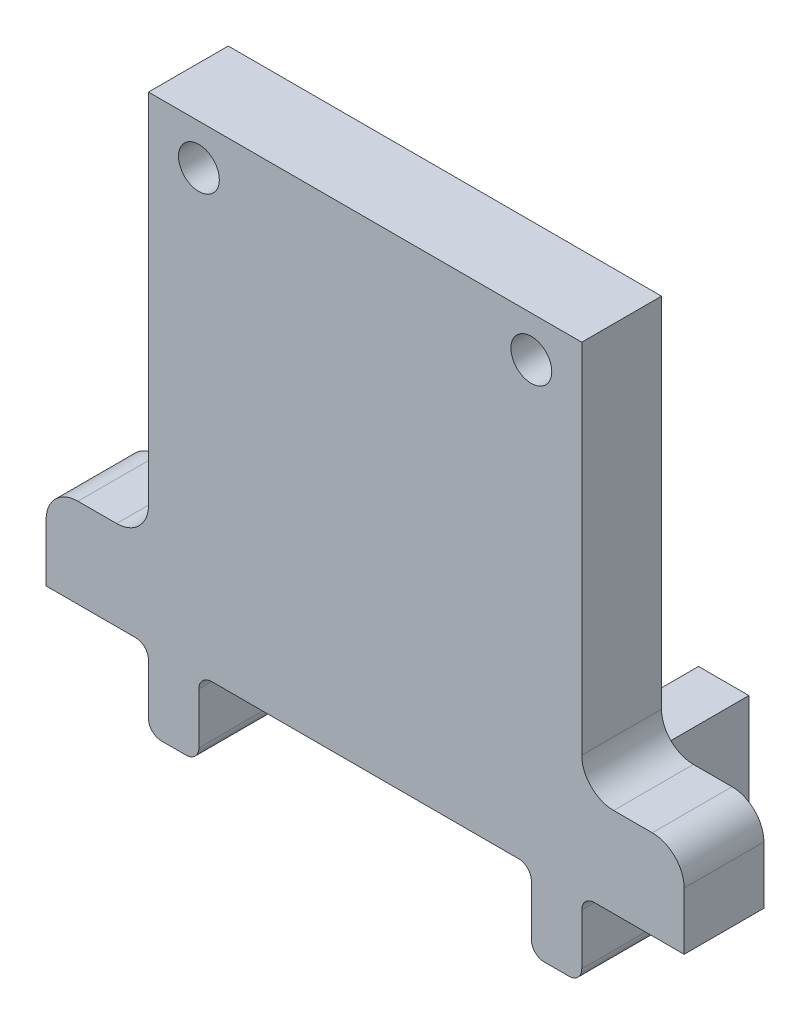
ISO-10303-21;
HEADER;
FILE_DESCRIPTION(('STEP AP214'),'2;1');
FILE_NAME('part.step','',(''),(''),'','','');
FILE_SCHEMA(('AUTOMOTIVE_DESIGN { 1 0 10303 214 1 1 1 1 }'));
ENDSEC;
DATA;
#1=APPLICATION_CONTEXT('core data for automotive mechanical design processes');
#2=APPLICATION_PROTOCOL_DEFINITION('international standard','automotive_design',2000,#1);
#3=PRODUCT_CONTEXT('',#1,'mechanical');
#4=PRODUCT('Part','Part','',(#3));
#5=PRODUCT_RELATED_PRODUCT_CATEGORY('part','',(#4));
#6=PRODUCT_DEFINITION_FORMATION('','',#4);
#7=PRODUCT_DEFINITION_CONTEXT('part definition',#1,'design');
#8=PRODUCT_DEFINITION('design','',#6,#7);
#9=PRODUCT_DEFINITION_SHAPE('','',#8);
#10=(LENGTH_UNIT() NAMED_UNIT(*) SI_UNIT(.MILLI.,.METRE.));
#11=(NAMED_UNIT(*) PLANE_ANGLE_UNIT() SI_UNIT($,.RADIAN.));
#12=(NAMED_UNIT(*) SI_UNIT($,.STERADIAN.) SOLID_ANGLE_UNIT());
#13=UNCERTAINTY_MEASURE_WITH_UNIT(LENGTH_MEASURE(1.E-05),#10,'distance_accuracy_value','');
#14=(GEOMETRIC_REPRESENTATION_CONTEXT(3) GLOBAL_UNCERTAINTY_ASSIGNED_CONTEXT((#13)) GLOBAL_UNIT_ASSIGNED_CONTEXT((#10,
#11,#12)) REPRESENTATION_CONTEXT('',''));
#15=CARTESIAN_POINT('',(0.,0.,0.));
#16=DIRECTION('',(0.,0.,1.));
#17=DIRECTION('',(1.,0.,0.));
#18=AXIS2_PLACEMENT_3D('',#15,#16,#17);
#19=CARTESIAN_POINT('',(0.,13.,0.));
#20=DIRECTION('',(0.,-1.,0.));
#21=DIRECTION('',(0.,0.,-1.));
#22=AXIS2_PLACEMENT_3D('',#19,#20,#21);
#23=PLANE('',#22);
#24=DIRECTION('',(1.,0.,0.));
#25=VECTOR('',#24,1.);
#26=CARTESIAN_POINT('',(-1.975,13.,0.));
#27=LINE('',#26,#25);
#28=CARTESIAN_POINT('',(34.475,13.,0.));
#29=VERTEX_POINT('',#28);
#30=CARTESIAN_POINT('',(37.5,13.,0.));
#31=VERTEX_POINT('',#30);
#32=EDGE_CURVE('E354',#29,#31,#27,.T.);
#33=ORIENTED_EDGE('',*,*,#32,.T.);
#34=DIRECTION('',(0.,0.,1.));
#35=VECTOR('',#34,1.);
#36=CARTESIAN_POINT('',(37.5,13.,-6.25000000000002));
#37=LINE('',#36,#35);
#38=CARTESIAN_POINT('',(37.5,13.,-6.25000000000002));
#39=VERTEX_POINT('',#38);
#40=EDGE_CURVE('E425',#31,#39,#37,.F.);
#41=ORIENTED_EDGE('',*,*,#40,.T.);
#42=DIRECTION('',(1.,0.,0.));
#43=VECTOR('',#42,1.);
#44=CARTESIAN_POINT('',(31.975,13.,-6.25000000000001));
#45=LINE('',#44,#43);
#46=CARTESIAN_POINT('',(34.475,13.,-6.25000000000001));
#47=VERTEX_POINT('',#46);
#48=EDGE_CURVE('E297',#47,#39,#45,.T.);
#49=ORIENTED_EDGE('',*,*,#48,.F.);
#50=DIRECTION('',(0.,0.,-1.));
#51=VECTOR('',#50,1.);
#52=CARTESIAN_POINT('',(34.475,13.,0.));
#53=LINE('',#52,#51);
#54=EDGE_CURVE('E423',#47,#29,#53,.F.);
#55=ORIENTED_EDGE('',*,*,#54,.T.);
#56=EDGE_LOOP('',(#33,#41,#49,#55));
#57=FACE_BOUND('',#56,.T.);
#58=ADVANCED_FACE('F41',(#57),#23,.F.);
#59=DIRECTION('',(-1.,0.,0.));
#60=VECTOR('',#59,1.);
#61=CARTESIAN_POINT('',(-1.975,13.,-6.25));
#62=LINE('',#61,#60);
#63=CARTESIAN_POINT('',(31.975,13.,-6.25000000000001));
#64=VERTEX_POINT('',#63);
#65=CARTESIAN_POINT('',(28.025,13.,-6.25000000000001));
#66=VERTEX_POINT('',#65);
#67=EDGE_CURVE('E270',#64,#66,#62,.T.);
#68=ORIENTED_EDGE('',*,*,#67,.F.);
#69=DIRECTION('',(0.,0.,1.));
#70=VECTOR('',#69,1.);
#71=CARTESIAN_POINT('',(31.975,13.,-13.1));
#72=LINE('',#71,#70);
#73=CARTESIAN_POINT('',(31.975,13.,-13.1));
#74=VERTEX_POINT('',#73);
#75=EDGE_CURVE('E318',#74,#64,#72,.T.);
#76=ORIENTED_EDGE('',*,*,#75,.F.);
#77=DIRECTION('',(1.,0.,0.));
#78=VECTOR('',#77,1.);
#79=CARTESIAN_POINT('',(28.025,13.,-13.1));
#80=LINE('',#79,#78);
#81=CARTESIAN_POINT('',(28.025,13.,-13.1));
#82=VERTEX_POINT('',#81);
#83=EDGE_CURVE('E322',#82,#74,#80,.T.);
#84=ORIENTED_EDGE('',*,*,#83,.F.);
#85=DIRECTION('',(0.,0.,-1.));
#86=VECTOR('',#85,1.);
#87=CARTESIAN_POINT('',(28.025,13.,-13.1));
#88=LINE('',#87,#86);
#89=EDGE_CURVE('E321',#66,#82,#88,.T.);
#90=ORIENTED_EDGE('',*,*,#89,.F.);
#91=EDGE_LOOP('',(#68,#76,#84,#90));
#92=FACE_BOUND('',#91,.T.);
#93=ADVANCED_FACE('F558',(#92),#23,.F.);
#94=DIRECTION('',(1.,0.,0.));
#95=VECTOR('',#94,1.);
#96=CARTESIAN_POINT('',(-1.975,13.,-6.25));
#97=LINE('',#96,#95);
#98=CARTESIAN_POINT('',(-7.5,13.,-6.25));
#99=VERTEX_POINT('',#98);
#100=CARTESIAN_POINT('',(-4.475,13.,-6.25));
#101=VERTEX_POINT('',#100);
#102=EDGE_CURVE('E308',#99,#101,#97,.T.);
#103=ORIENTED_EDGE('',*,*,#102,.F.);
#104=DIRECTION('',(0.,0.,1.));
#105=VECTOR('',#104,1.);
#106=CARTESIAN_POINT('',(-7.5,13.,0.));
#107=LINE('',#106,#105);
#108=CARTESIAN_POINT('',(-7.5,13.,0.));
#109=VERTEX_POINT('',#108);
#110=EDGE_CURVE('E432',#99,#109,#107,.T.);
#111=ORIENTED_EDGE('',*,*,#110,.T.);
#112=CARTESIAN_POINT('',(-4.475,13.,0.));
#113=VERTEX_POINT('',#112);
#114=EDGE_CURVE('E356',#109,#113,#27,.T.);
#115=ORIENTED_EDGE('',*,*,#114,.T.);
#116=DIRECTION('',(0.,0.,1.));
#117=VECTOR('',#116,1.);
#118=CARTESIAN_POINT('',(-4.475,13.,-6.25));
#119=LINE('',#118,#117);
#120=EDGE_CURVE('E430',#113,#101,#119,.F.);
#121=ORIENTED_EDGE('',*,*,#120,.T.);
#122=EDGE_LOOP('',(#103,#111,#115,#121));
#123=FACE_BOUND('',#122,.T.);
#124=ADVANCED_FACE('F565',(#123),#23,.F.);
#125=CARTESIAN_POINT('',(1.975,13.,-6.25));
#126=VERTEX_POINT('',#125);
#127=CARTESIAN_POINT('',(-1.975,13.,-6.25));
#128=VERTEX_POINT('',#127);
#129=EDGE_CURVE('E415',#126,#128,#62,.T.);
#130=ORIENTED_EDGE('',*,*,#129,.F.);
#131=DIRECTION('',(0.,0.,-1.));
#132=VECTOR('',#131,1.);
#133=CARTESIAN_POINT('',(1.975,13.,0.));
#134=LINE('',#133,#132);
#135=CARTESIAN_POINT('',(1.97499999999999,13.,-13.1));
#136=VERTEX_POINT('',#135);
#137=EDGE_CURVE('E359',#126,#136,#134,.T.);
#138=ORIENTED_EDGE('',*,*,#137,.T.);
#139=DIRECTION('',(-1.,0.,0.));
#140=VECTOR('',#139,1.);
#141=CARTESIAN_POINT('',(-1.975,13.,-13.1));
#142=LINE('',#141,#140);
#143=CARTESIAN_POINT('',(-1.975,13.,-13.1));
#144=VERTEX_POINT('',#143);
#145=EDGE_CURVE('E361',#136,#144,#142,.T.);
#146=ORIENTED_EDGE('',*,*,#145,.T.);
#147=DIRECTION('',(0.,0.,1.));
#148=VECTOR('',#147,1.);
#149=CARTESIAN_POINT('',(-1.975,13.,0.));
#150=LINE('',#149,#148);
#151=EDGE_CURVE('E352',#144,#128,#150,.T.);
#152=ORIENTED_EDGE('',*,*,#151,.T.);
#153=EDGE_LOOP('',(#130,#138,#146,#152));
#154=FACE_BOUND('',#153,.T.);
#155=ADVANCED_FACE('F560',(#154),#23,.F.);
#156=CARTESIAN_POINT('',(31.975,26.6825618946161,-13.1));
#157=DIRECTION('',(-1.,0.,0.));
#158=DIRECTION('',(0.,0.,1.));
#159=AXIS2_PLACEMENT_3D('',#156,#157,#158);
#160=PLANE('',#159);
#161=DIRECTION('',(0.,1.,0.));
#162=VECTOR('',#161,1.);
#163=CARTESIAN_POINT('',(31.975,13.,-6.25000000000001));
#164=LINE('',#163,#162);
#165=CARTESIAN_POINT('',(31.975,5.,-6.25000000000001));
#166=VERTEX_POINT('',#165);
#167=EDGE_CURVE('E279',#166,#64,#164,.T.);
#168=ORIENTED_EDGE('',*,*,#167,.F.);
#169=DIRECTION('',(0.,0.,1.));
#170=VECTOR('',#169,1.);
#171=CARTESIAN_POINT('',(31.975,5.,-13.1));
#172=LINE('',#171,#170);
#173=CARTESIAN_POINT('',(31.975,5.,0.));
#174=VERTEX_POINT('',#173);
#175=EDGE_CURVE('E463',#166,#174,#172,.T.);
#176=ORIENTED_EDGE('',*,*,#175,.T.);
#177=DIRECTION('',(0.,-1.,0.));
#178=VECTOR('',#177,1.);
#179=CARTESIAN_POINT('',(31.975,26.6825618946161,0.));
#180=LINE('',#179,#178);
#181=CARTESIAN_POINT('',(31.975,1.,0.));
#182=VERTEX_POINT('',#181);
#183=EDGE_CURVE('E335',#174,#182,#180,.T.);
#184=ORIENTED_EDGE('',*,*,#183,.T.);
#185=DIRECTION('',(0.,0.,-1.));
#186=VECTOR('',#185,1.);
#187=CARTESIAN_POINT('',(31.975,1.,-13.1));
#188=LINE('',#187,#186);
#189=CARTESIAN_POINT('',(31.975,1.,-13.1));
#190=VERTEX_POINT('',#189);
#191=EDGE_CURVE('E377',#182,#190,#188,.T.);
#192=ORIENTED_EDGE('',*,*,#191,.T.);
#193=DIRECTION('',(0.,-1.,0.));
#194=VECTOR('',#193,1.);
#195=CARTESIAN_POINT('',(31.975,26.6825618946161,-13.1));
#196=LINE('',#195,#194);
#197=EDGE_CURVE('E332',#74,#190,#196,.T.);
#198=ORIENTED_EDGE('',*,*,#197,.F.);
#199=ORIENTED_EDGE('',*,*,#75,.T.);
#200=EDGE_LOOP('',(#168,#176,#184,#192,#198,#199));
#201=FACE_BOUND('',#200,.T.);
#202=ADVANCED_FACE('F515',(#201),#160,.F.);
#203=CARTESIAN_POINT('',(-1.975,13.,0.));
#204=DIRECTION('',(1.,0.,0.));
#205=DIRECTION('',(0.,0.,-1.));
#206=AXIS2_PLACEMENT_3D('',#203,#204,#205);
#207=PLANE('',#206);
#208=DIRECTION('',(0.,-1.,0.));
#209=VECTOR('',#208,1.);
#210=CARTESIAN_POINT('',(-1.975,13.,0.));
#211=LINE('',#210,#209);
#212=CARTESIAN_POINT('',(-1.975,5.,0.));
#213=VERTEX_POINT('',#212);
#214=CARTESIAN_POINT('',(-1.975,1.,0.));
#215=VERTEX_POINT('',#214);
#216=EDGE_CURVE('E375',#213,#215,#211,.T.);
#217=ORIENTED_EDGE('',*,*,#216,.F.);
#218=DIRECTION('',(0.,0.,1.));
#219=VECTOR('',#218,1.);
#220=CARTESIAN_POINT('',(-1.975,5.,0.));
#221=LINE('',#220,#219);
#222=CARTESIAN_POINT('',(-1.975,5.,-6.25));
#223=VERTEX_POINT('',#222);
#224=EDGE_CURVE('E453',#213,#223,#221,.F.);
#225=ORIENTED_EDGE('',*,*,#224,.T.);
#226=DIRECTION('',(0.,-1.,0.));
#227=VECTOR('',#226,1.);
#228=CARTESIAN_POINT('',(-1.975,13.,-6.25));
#229=LINE('',#228,#227);
#230=EDGE_CURVE('E306',#128,#223,#229,.T.);
#231=ORIENTED_EDGE('',*,*,#230,.F.);
#232=ORIENTED_EDGE('',*,*,#151,.F.);
#233=DIRECTION('',(0.,-1.,0.));
#234=VECTOR('',#233,1.);
#235=CARTESIAN_POINT('',(-1.975,13.,-13.1));
#236=LINE('',#235,#234);
#237=CARTESIAN_POINT('',(-1.975,1.,-13.1));
#238=VERTEX_POINT('',#237);
#239=EDGE_CURVE('E363',#144,#238,#236,.T.);
#240=ORIENTED_EDGE('',*,*,#239,.T.);
#241=DIRECTION('',(0.,0.,1.));
#242=VECTOR('',#241,1.);
#243=CARTESIAN_POINT('',(-1.975,0.999999999999999,0.));
#244=LINE('',#243,#242);
#245=EDGE_CURVE('E412',#238,#215,#244,.T.);
#246=ORIENTED_EDGE('',*,*,#245,.T.);
#247=EDGE_LOOP('',(#217,#225,#231,#232,#240,#246));
#248=FACE_BOUND('',#247,.T.);
#249=ADVANCED_FACE('F575',(#248),#207,.F.);
#250=CARTESIAN_POINT('',(1.975,13.,0.));
#251=DIRECTION('',(-1.,0.,0.));
#252=DIRECTION('',(0.,0.,1.));
#253=AXIS2_PLACEMENT_3D('',#250,#251,#252);
#254=PLANE('',#253);
#255=DIRECTION('',(0.,1.,0.));
#256=VECTOR('',#255,1.);
#257=CARTESIAN_POINT('',(1.975,13.,-6.25));
#258=LINE('',#257,#256);
#259=CARTESIAN_POINT('',(1.975,5.,-6.25));
#260=VERTEX_POINT('',#259);
#261=EDGE_CURVE('E341',#260,#126,#258,.T.);
#262=ORIENTED_EDGE('',*,*,#261,.F.);
#263=DIRECTION('',(0.,0.,-1.));
#264=VECTOR('',#263,1.);
#265=CARTESIAN_POINT('',(1.975,5.,0.));
#266=LINE('',#265,#264);
#267=CARTESIAN_POINT('',(1.975,5.,0.));
#268=VERTEX_POINT('',#267);
#269=EDGE_CURVE('E461',#260,#268,#266,.F.);
#270=ORIENTED_EDGE('',*,*,#269,.T.);
#271=DIRECTION('',(0.,-1.,0.));
#272=VECTOR('',#271,1.);
#273=CARTESIAN_POINT('',(1.975,13.,0.));
#274=LINE('',#273,#272);
#275=CARTESIAN_POINT('',(1.975,1.,0.));
#276=VERTEX_POINT('',#275);
#277=EDGE_CURVE('E373',#268,#276,#274,.T.);
#278=ORIENTED_EDGE('',*,*,#277,.T.);
#279=DIRECTION('',(0.,0.,-1.));
#280=VECTOR('',#279,1.);
#281=CARTESIAN_POINT('',(1.97499999999999,0.999999999999999,-13.1));
#282=LINE('',#281,#280);
#283=CARTESIAN_POINT('',(1.97499999999999,1.,-13.1));
#284=VERTEX_POINT('',#283);
#285=EDGE_CURVE('E401',#276,#284,#282,.T.);
#286=ORIENTED_EDGE('',*,*,#285,.T.);
#287=DIRECTION('',(0.,-1.,0.));
#288=VECTOR('',#287,1.);
#289=CARTESIAN_POINT('',(1.97499999999999,13.,-13.1));
#290=LINE('',#289,#288);
#291=EDGE_CURVE('E370',#136,#284,#290,.T.);
#292=ORIENTED_EDGE('',*,*,#291,.F.);
#293=ORIENTED_EDGE('',*,*,#137,.F.);
#294=EDGE_LOOP('',(#262,#270,#278,#286,#292,#293));
#295=FACE_BOUND('',#294,.T.);
#296=ADVANCED_FACE('F585',(#295),#254,.F.);
#297=CARTESIAN_POINT('',(-1.975,13.,0.));
#298=DIRECTION('',(0.,0.,-1.));
#299=DIRECTION('',(-1.,0.,0.));
#300=AXIS2_PLACEMENT_3D('',#297,#298,#299);
#301=PLANE('',#300);
#302=CARTESIAN_POINT('',(1.975,40.3533,0.));
#303=DIRECTION('',(0.,0.,1.));
#304=DIRECTION('',(1.,0.,0.));
#305=AXIS2_PLACEMENT_3D('',#302,#303,#304);
#306=CIRCLE('',#305,1.59999999999999);
#307=CARTESIAN_POINT('',(3.57499999999998,40.3533,0.));
#308=VERTEX_POINT('',#307);
#309=EDGE_CURVE('E992',#308,#308,#306,.T.);
#310=ORIENTED_EDGE('',*,*,#309,.F.);
#311=EDGE_LOOP('',(#310));
#312=FACE_BOUND('',#311,.T.);
#313=CARTESIAN_POINT('',(28.025,40.3533,0.));
#314=DIRECTION('',(0.,0.,1.));
#315=DIRECTION('',(1.,0.,0.));
#316=AXIS2_PLACEMENT_3D('',#313,#314,#315);
#317=CIRCLE('',#316,1.59999999999999);
#318=CARTESIAN_POINT('',(29.625,40.3533,0.));
#319=VERTEX_POINT('',#318);
#320=EDGE_CURVE('E966',#319,#319,#317,.T.);
#321=ORIENTED_EDGE('',*,*,#320,.F.);
#322=EDGE_LOOP('',(#321));
#323=FACE_BOUND('',#322,.T.);
#324=DIRECTION('',(0.,1.,0.));
#325=VECTOR('',#324,1.);
#326=CARTESIAN_POINT('',(40.,13.,0.));
#327=LINE('',#326,#325);
#328=CARTESIAN_POINT('',(40.,6.,0.));
#329=VERTEX_POINT('',#328);
#330=CARTESIAN_POINT('',(40.,10.5,0.));
#331=VERTEX_POINT('',#330);
#332=EDGE_CURVE('E288',#329,#331,#327,.T.);
#333=ORIENTED_EDGE('',*,*,#332,.T.);
#334=CARTESIAN_POINT('',(37.5,10.5,0.));
#335=DIRECTION('',(0.,0.,-1.));
#336=DIRECTION('',(-1.,0.,0.));
#337=AXIS2_PLACEMENT_3D('',#334,#335,#336);
#338=CIRCLE('',#337,2.5);
#339=EDGE_CURVE('E421',#331,#31,#338,.F.);
#340=ORIENTED_EDGE('',*,*,#339,.T.);
#341=ORIENTED_EDGE('',*,*,#32,.F.);
#342=CARTESIAN_POINT('',(34.475,15.5,0.));
#343=DIRECTION('',(0.,0.,-1.));
#344=DIRECTION('',(-1.,0.,0.));
#345=AXIS2_PLACEMENT_3D('',#342,#343,#344);
#346=CIRCLE('',#345,2.5);
#347=CARTESIAN_POINT('',(31.975,15.5,0.));
#348=VERTEX_POINT('',#347);
#349=EDGE_CURVE('E444',#29,#348,#346,.T.);
#350=ORIENTED_EDGE('',*,*,#349,.T.);
#351=DIRECTION('',(0.,-1.,0.));
#352=VECTOR('',#351,1.);
#353=CARTESIAN_POINT('',(31.975,43.5283,0.));
#354=LINE('',#353,#352);
#355=CARTESIAN_POINT('',(31.975,43.5283,0.));
#356=VERTEX_POINT('',#355);
#357=EDGE_CURVE('E977',#356,#348,#354,.T.);
#358=ORIENTED_EDGE('',*,*,#357,.F.);
#359=DIRECTION('',(1.,0.,0.));
#360=VECTOR('',#359,1.);
#361=CARTESIAN_POINT('',(-1.975,43.5283,0.));
#362=LINE('',#361,#360);
#363=CARTESIAN_POINT('',(-1.975,43.5283,0.));
#364=VERTEX_POINT('',#363);
#365=EDGE_CURVE('E266',#364,#356,#362,.T.);
#366=ORIENTED_EDGE('',*,*,#365,.F.);
#367=DIRECTION('',(0.,-1.,0.));
#368=VECTOR('',#367,1.);
#369=CARTESIAN_POINT('',(-1.975,43.5283,0.));
#370=LINE('',#369,#368);
#371=CARTESIAN_POINT('',(-1.975,15.5,0.));
#372=VERTEX_POINT('',#371);
#373=EDGE_CURVE('E281',#364,#372,#370,.T.);
#374=ORIENTED_EDGE('',*,*,#373,.T.);
#375=CARTESIAN_POINT('',(-4.475,15.5,0.));
#376=DIRECTION('',(0.,0.,-1.));
#377=DIRECTION('',(-1.,0.,0.));
#378=AXIS2_PLACEMENT_3D('',#375,#376,#377);
#379=CIRCLE('',#378,2.5);
#380=EDGE_CURVE('E446',#372,#113,#379,.T.);
#381=ORIENTED_EDGE('',*,*,#380,.T.);
#382=ORIENTED_EDGE('',*,*,#114,.F.);
#383=CARTESIAN_POINT('',(-7.5,10.5,0.));
#384=DIRECTION('',(0.,0.,-1.));
#385=DIRECTION('',(-1.,0.,0.));
#386=AXIS2_PLACEMENT_3D('',#383,#384,#385);
#387=CIRCLE('',#386,2.5);
#388=CARTESIAN_POINT('',(-10.,10.5,0.));
#389=VERTEX_POINT('',#388);
#390=EDGE_CURVE('E419',#109,#389,#387,.F.);
#391=ORIENTED_EDGE('',*,*,#390,.T.);
#392=DIRECTION('',(0.,-1.,0.));
#393=VECTOR('',#392,1.);
#394=CARTESIAN_POINT('',(-10.,13.,0.));
#395=LINE('',#394,#393);
#396=CARTESIAN_POINT('',(-10.,5.99999999999999,0.));
#397=VERTEX_POINT('',#396);
#398=EDGE_CURVE('E294',#389,#397,#395,.T.);
#399=ORIENTED_EDGE('',*,*,#398,.T.);
#400=DIRECTION('',(1.,0.,0.));
#401=VECTOR('',#400,1.);
#402=CARTESIAN_POINT('',(-1.975,6.,0.));
#403=LINE('',#402,#401);
#404=CARTESIAN_POINT('',(-2.975,6.,0.));
#405=VERTEX_POINT('',#404);
#406=EDGE_CURVE('E310',#397,#405,#403,.T.);
#407=ORIENTED_EDGE('',*,*,#406,.T.);
#408=CARTESIAN_POINT('',(-2.975,5.,0.));
#409=DIRECTION('',(0.,0.,-1.));
#410=DIRECTION('',(-1.,0.,0.));
#411=AXIS2_PLACEMENT_3D('',#408,#409,#410);
#412=CIRCLE('',#411,1.);
#413=EDGE_CURVE('E471',#405,#213,#412,.T.);
#414=ORIENTED_EDGE('',*,*,#413,.T.);
#415=ORIENTED_EDGE('',*,*,#216,.T.);
#416=CARTESIAN_POINT('',(-0.975,0.999999999999999,0.));
#417=DIRECTION('',(0.,0.,-1.));
#418=DIRECTION('',(-1.,0.,0.));
#419=AXIS2_PLACEMENT_3D('',#416,#417,#418);
#420=CIRCLE('',#419,1.);
#421=CARTESIAN_POINT('',(-0.975,0.,0.));
#422=VERTEX_POINT('',#421);
#423=EDGE_CURVE('E388',#215,#422,#420,.F.);
#424=ORIENTED_EDGE('',*,*,#423,.T.);
#425=DIRECTION('',(1.,0.,0.));
#426=VECTOR('',#425,1.);
#427=CARTESIAN_POINT('',(-1.975,0.,0.));
#428=LINE('',#427,#426);
#429=CARTESIAN_POINT('',(0.975,0.,0.));
#430=VERTEX_POINT('',#429);
#431=EDGE_CURVE('E344',#422,#430,#428,.T.);
#432=ORIENTED_EDGE('',*,*,#431,.T.);
#433=CARTESIAN_POINT('',(0.975,0.999999999999999,0.));
#434=DIRECTION('',(0.,0.,-1.));
#435=DIRECTION('',(-1.,0.,0.));
#436=AXIS2_PLACEMENT_3D('',#433,#434,#435);
#437=CIRCLE('',#436,1.);
#438=EDGE_CURVE('E390',#430,#276,#437,.F.);
#439=ORIENTED_EDGE('',*,*,#438,.T.);
#440=ORIENTED_EDGE('',*,*,#277,.F.);
#441=CARTESIAN_POINT('',(2.975,5.,0.));
#442=DIRECTION('',(0.,0.,-1.));
#443=DIRECTION('',(-1.,0.,0.));
#444=AXIS2_PLACEMENT_3D('',#441,#442,#443);
#445=CIRCLE('',#444,1.);
#446=CARTESIAN_POINT('',(2.975,6.,0.));
#447=VERTEX_POINT('',#446);
#448=EDGE_CURVE('E478',#268,#447,#445,.T.);
#449=ORIENTED_EDGE('',*,*,#448,.T.);
#450=DIRECTION('',(-1.,0.,0.));
#451=VECTOR('',#450,1.);
#452=CARTESIAN_POINT('',(31.977,6.,0.));
#453=LINE('',#452,#451);
#454=CARTESIAN_POINT('',(27.025,6.,0.));
#455=VERTEX_POINT('',#454);
#456=EDGE_CURVE('E346',#455,#447,#453,.T.);
#457=ORIENTED_EDGE('',*,*,#456,.F.);
#458=CARTESIAN_POINT('',(27.025,5.,0.));
#459=DIRECTION('',(0.,0.,-1.));
#460=DIRECTION('',(-1.,0.,0.));
#461=AXIS2_PLACEMENT_3D('',#458,#459,#460);
#462=CIRCLE('',#461,1.);
#463=CARTESIAN_POINT('',(28.025,5.,0.));
#464=VERTEX_POINT('',#463);
#465=EDGE_CURVE('E11',#455,#464,#462,.T.);
#466=ORIENTED_EDGE('',*,*,#465,.T.);
#467=DIRECTION('',(0.,-1.,0.));
#468=VECTOR('',#467,1.);
#469=CARTESIAN_POINT('',(28.025,26.6825618946161,0.));
#470=LINE('',#469,#468);
#471=CARTESIAN_POINT('',(28.025,1.,0.));
#472=VERTEX_POINT('',#471);
#473=EDGE_CURVE('E337',#464,#472,#470,.T.);
#474=ORIENTED_EDGE('',*,*,#473,.T.);
#475=CARTESIAN_POINT('',(29.025,1.,0.));
#476=DIRECTION('',(0.,0.,-1.));
#477=DIRECTION('',(-1.,0.,0.));
#478=AXIS2_PLACEMENT_3D('',#475,#476,#477);
#479=CIRCLE('',#478,1.);
#480=CARTESIAN_POINT('',(29.025,0.,0.));
#481=VERTEX_POINT('',#480);
#482=EDGE_CURVE('E393',#472,#481,#479,.F.);
#483=ORIENTED_EDGE('',*,*,#482,.T.);
#484=DIRECTION('',(1.,0.,0.));
#485=VECTOR('',#484,1.);
#486=CARTESIAN_POINT('',(28.025,0.,0.));
#487=LINE('',#486,#485);
#488=CARTESIAN_POINT('',(30.975,0.,0.));
#489=VERTEX_POINT('',#488);
#490=EDGE_CURVE('E317',#481,#489,#487,.T.);
#491=ORIENTED_EDGE('',*,*,#490,.T.);
#492=CARTESIAN_POINT('',(30.975,1.,0.));
#493=DIRECTION('',(0.,0.,-1.));
#494=DIRECTION('',(-1.,0.,0.));
#495=AXIS2_PLACEMENT_3D('',#492,#493,#494);
#496=CIRCLE('',#495,1.);
#497=EDGE_CURVE('E395',#489,#182,#496,.F.);
#498=ORIENTED_EDGE('',*,*,#497,.T.);
#499=ORIENTED_EDGE('',*,*,#183,.F.);
#500=CARTESIAN_POINT('',(32.975,5.,0.));
#501=DIRECTION('',(0.,0.,-1.));
#502=DIRECTION('',(-1.,0.,0.));
#503=AXIS2_PLACEMENT_3D('',#500,#501,#502);
#504=CIRCLE('',#503,1.);
#505=CARTESIAN_POINT('',(32.975,6.,0.));
#506=VERTEX_POINT('',#505);
#507=EDGE_CURVE('E480',#174,#506,#504,.T.);
#508=ORIENTED_EDGE('',*,*,#507,.T.);
#509=DIRECTION('',(1.,0.,0.));
#510=VECTOR('',#509,1.);
#511=CARTESIAN_POINT('',(31.975,6.,0.));
#512=LINE('',#511,#510);
#513=EDGE_CURVE('E292',#506,#329,#512,.T.);
#514=ORIENTED_EDGE('',*,*,#513,.T.);
#515=EDGE_LOOP('',(#333,#340,#341,#350,#358,#366,#374,#381,#382,#391,#399,#407,#414,#415,#424,
#432,#439,#440,#449,#457,#466,#474,#483,#491,#498,#499,#508,#514));
#516=FACE_BOUND('',#515,.T.);
#517=ADVANCED_FACE('F496',(#312,#323,#516),#301,.F.);
#518=CARTESIAN_POINT('',(-1.975,13.,-13.1));
#519=DIRECTION('',(0.,0.,1.));
#520=DIRECTION('',(1.,0.,0.));
#521=AXIS2_PLACEMENT_3D('',#518,#519,#520);
#522=PLANE('',#521);
#523=ORIENTED_EDGE('',*,*,#291,.T.);
#524=CARTESIAN_POINT('',(0.974999999999995,0.999999999999999,-13.1));
#525=DIRECTION('',(0.,0.,1.));
#526=DIRECTION('',(1.,0.,0.));
#527=AXIS2_PLACEMENT_3D('',#524,#525,#526);
#528=CIRCLE('',#527,1.);
#529=CARTESIAN_POINT('',(0.974999999999995,0.,-13.1));
#530=VERTEX_POINT('',#529);
#531=EDGE_CURVE('E406',#284,#530,#528,.F.);
#532=ORIENTED_EDGE('',*,*,#531,.T.);
#533=DIRECTION('',(-1.,0.,0.));
#534=VECTOR('',#533,1.);
#535=CARTESIAN_POINT('',(-1.975,0.,-13.1));
#536=LINE('',#535,#534);
#537=CARTESIAN_POINT('',(-0.975,0.,-13.1));
#538=VERTEX_POINT('',#537);
#539=EDGE_CURVE('E355',#530,#538,#536,.T.);
#540=ORIENTED_EDGE('',*,*,#539,.T.);
#541=CARTESIAN_POINT('',(-0.975,0.999999999999999,-13.1));
#542=DIRECTION('',(0.,0.,1.));
#543=DIRECTION('',(1.,0.,0.));
#544=AXIS2_PLACEMENT_3D('',#541,#542,#543);
#545=CIRCLE('',#544,1.);
#546=EDGE_CURVE('E404',#538,#238,#545,.F.);
#547=ORIENTED_EDGE('',*,*,#546,.T.);
#548=ORIENTED_EDGE('',*,*,#239,.F.);
#549=ORIENTED_EDGE('',*,*,#145,.F.);
#550=EDGE_LOOP('',(#523,#532,#540,#547,#548,#549));
#551=FACE_BOUND('',#550,.T.);
#552=ADVANCED_FACE('F599',(#551),#522,.F.);
#553=CARTESIAN_POINT('',(0.,0.,0.));
#554=DIRECTION('',(0.,-1.,0.));
#555=DIRECTION('',(0.,0.,-1.));
#556=AXIS2_PLACEMENT_3D('',#553,#554,#555);
#557=PLANE('',#556);
#558=ORIENTED_EDGE('',*,*,#539,.F.);
#559=DIRECTION('',(0.,0.,-1.));
#560=VECTOR('',#559,1.);
#561=CARTESIAN_POINT('',(0.975,0.,0.));
#562=LINE('',#561,#560);
#563=EDGE_CURVE('E410',#530,#430,#562,.F.);
#564=ORIENTED_EDGE('',*,*,#563,.T.);
#565=ORIENTED_EDGE('',*,*,#431,.F.);
#566=DIRECTION('',(0.,0.,1.));
#567=VECTOR('',#566,1.);
#568=CARTESIAN_POINT('',(-0.975,0.,-13.1));
#569=LINE('',#568,#567);
#570=EDGE_CURVE('E408',#422,#538,#569,.F.);
#571=ORIENTED_EDGE('',*,*,#570,.T.);
#572=EDGE_LOOP('',(#558,#564,#565,#571));
#573=FACE_BOUND('',#572,.T.);
#574=ADVANCED_FACE('F622',(#573),#557,.T.);
#575=CARTESIAN_POINT('',(31.977,6.,0.));
#576=DIRECTION('',(0.,1.,0.));
#577=DIRECTION('',(0.,0.,1.));
#578=AXIS2_PLACEMENT_3D('',#575,#576,#577);
#579=PLANE('',#578);
#580=ORIENTED_EDGE('',*,*,#456,.T.);
#581=DIRECTION('',(0.,0.,-1.));
#582=VECTOR('',#581,1.);
#583=CARTESIAN_POINT('',(2.975,6.,-6.25));
#584=LINE('',#583,#582);
#585=CARTESIAN_POINT('',(2.975,6.,-6.25));
#586=VERTEX_POINT('',#585);
#587=EDGE_CURVE('E458',#447,#586,#584,.T.);
#588=ORIENTED_EDGE('',*,*,#587,.T.);
#589=DIRECTION('',(-1.,0.,0.));
#590=VECTOR('',#589,1.);
#591=CARTESIAN_POINT('',(31.977,6.,-6.25000000000001));
#592=LINE('',#591,#590);
#593=CARTESIAN_POINT('',(27.025,6.,-6.25000000000001));
#594=VERTEX_POINT('',#593);
#595=EDGE_CURVE('E345',#594,#586,#592,.T.);
#596=ORIENTED_EDGE('',*,*,#595,.F.);
#597=DIRECTION('',(0.,0.,-1.));
#598=VECTOR('',#597,1.);
#599=CARTESIAN_POINT('',(27.025,6.,0.));
#600=LINE('',#599,#598);
#601=EDGE_CURVE('E456',#594,#455,#600,.F.);
#602=ORIENTED_EDGE('',*,*,#601,.T.);
#603=EDGE_LOOP('',(#580,#588,#596,#602));
#604=FACE_BOUND('',#603,.T.);
#605=ADVANCED_FACE('F489',(#604),#579,.F.);
#606=CARTESIAN_POINT('',(28.025,26.6825618946161,-13.1));
#607=DIRECTION('',(1.,0.,0.));
#608=DIRECTION('',(0.,0.,-1.));
#609=AXIS2_PLACEMENT_3D('',#606,#607,#608);
#610=PLANE('',#609);
#611=ORIENTED_EDGE('',*,*,#473,.F.);
#612=DIRECTION('',(0.,0.,-1.));
#613=VECTOR('',#612,1.);
#614=CARTESIAN_POINT('',(28.025,5.,-6.25000000000001));
#615=LINE('',#614,#613);
#616=CARTESIAN_POINT('',(28.025,5.,-6.25000000000001));
#617=VERTEX_POINT('',#616);
#618=EDGE_CURVE('E468',#464,#617,#615,.T.);
#619=ORIENTED_EDGE('',*,*,#618,.T.);
#620=DIRECTION('',(0.,1.,0.));
#621=VECTOR('',#620,1.);
#622=CARTESIAN_POINT('',(28.025,13.,-6.25000000000001));
#623=LINE('',#622,#621);
#624=EDGE_CURVE('E56',#617,#66,#623,.T.);
#625=ORIENTED_EDGE('',*,*,#624,.T.);
#626=ORIENTED_EDGE('',*,*,#89,.T.);
#627=DIRECTION('',(0.,-1.,0.));
#628=VECTOR('',#627,1.);
#629=CARTESIAN_POINT('',(28.025,26.6825618946161,-13.1));
#630=LINE('',#629,#628);
#631=CARTESIAN_POINT('',(28.025,1.,-13.1));
#632=VERTEX_POINT('',#631);
#633=EDGE_CURVE('E329',#82,#632,#630,.T.);
#634=ORIENTED_EDGE('',*,*,#633,.T.);
#635=DIRECTION('',(0.,0.,1.));
#636=VECTOR('',#635,1.);
#637=CARTESIAN_POINT('',(28.025,1.,-13.1));
#638=LINE('',#637,#636);
#639=EDGE_CURVE('E398',#632,#472,#638,.T.);
#640=ORIENTED_EDGE('',*,*,#639,.T.);
#641=EDGE_LOOP('',(#611,#619,#625,#626,#634,#640));
#642=FACE_BOUND('',#641,.T.);
#643=ADVANCED_FACE('F492',(#642),#610,.F.);
#644=CARTESIAN_POINT('',(0.,0.,0.));
#645=DIRECTION('',(0.,1.,0.));
#646=DIRECTION('',(0.,0.,1.));
#647=AXIS2_PLACEMENT_3D('',#644,#645,#646);
#648=PLANE('',#647);
#649=DIRECTION('',(-1.,0.,0.));
#650=VECTOR('',#649,1.);
#651=CARTESIAN_POINT('',(28.025,0.,-13.1));
#652=LINE('',#651,#650);
#653=CARTESIAN_POINT('',(30.975,0.,-13.1));
#654=VERTEX_POINT('',#653);
#655=CARTESIAN_POINT('',(29.025,0.,-13.1));
#656=VERTEX_POINT('',#655);
#657=EDGE_CURVE('E326',#654,#656,#652,.T.);
#658=ORIENTED_EDGE('',*,*,#657,.F.);
#659=DIRECTION('',(0.,0.,-1.));
#660=VECTOR('',#659,1.);
#661=CARTESIAN_POINT('',(30.975,0.,0.));
#662=LINE('',#661,#660);
#663=EDGE_CURVE('E386',#654,#489,#662,.F.);
#664=ORIENTED_EDGE('',*,*,#663,.T.);
#665=ORIENTED_EDGE('',*,*,#490,.F.);
#666=DIRECTION('',(0.,0.,1.));
#667=VECTOR('',#666,1.);
#668=CARTESIAN_POINT('',(29.025,0.,0.));
#669=LINE('',#668,#667);
#670=EDGE_CURVE('E384',#481,#656,#669,.F.);
#671=ORIENTED_EDGE('',*,*,#670,.T.);
#672=EDGE_LOOP('',(#658,#664,#665,#671));
#673=FACE_BOUND('',#672,.T.);
#674=ADVANCED_FACE('F504',(#673),#648,.F.);
#675=CARTESIAN_POINT('',(28.025,26.6825618946161,-13.1));
#676=DIRECTION('',(0.,0.,1.));
#677=DIRECTION('',(1.,0.,0.));
#678=AXIS2_PLACEMENT_3D('',#675,#676,#677);
#679=PLANE('',#678);
#680=ORIENTED_EDGE('',*,*,#197,.T.);
#681=CARTESIAN_POINT('',(30.975,1.,-13.1));
#682=DIRECTION('',(0.,0.,1.));
#683=DIRECTION('',(1.,0.,0.));
#684=AXIS2_PLACEMENT_3D('',#681,#682,#683);
#685=CIRCLE('',#684,1.);
#686=EDGE_CURVE('E382',#190,#654,#685,.F.);
#687=ORIENTED_EDGE('',*,*,#686,.T.);
#688=ORIENTED_EDGE('',*,*,#657,.T.);
#689=CARTESIAN_POINT('',(29.025,1.,-13.1));
#690=DIRECTION('',(0.,0.,1.));
#691=DIRECTION('',(1.,0.,0.));
#692=AXIS2_PLACEMENT_3D('',#689,#690,#691);
#693=CIRCLE('',#692,1.);
#694=EDGE_CURVE('E380',#656,#632,#693,.F.);
#695=ORIENTED_EDGE('',*,*,#694,.T.);
#696=ORIENTED_EDGE('',*,*,#633,.F.);
#697=ORIENTED_EDGE('',*,*,#83,.T.);
#698=EDGE_LOOP('',(#680,#687,#688,#695,#696,#697));
#699=FACE_BOUND('',#698,.T.);
#700=ADVANCED_FACE('F507',(#699),#679,.F.);
#701=CARTESIAN_POINT('',(-1.975,6.,-16.8989729551727));
#702=DIRECTION('',(0.,-1.,0.));
#703=DIRECTION('',(1.,0.,0.));
#704=AXIS2_PLACEMENT_3D('',#701,#702,#703);
#705=PLANE('',#704);
#706=DIRECTION('',(-1.,0.,0.));
#707=VECTOR('',#706,1.);
#708=CARTESIAN_POINT('',(-1.97499999999999,6.,-6.25));
#709=LINE('',#708,#707);
#710=CARTESIAN_POINT('',(-2.975,6.,-6.25));
#711=VERTEX_POINT('',#710);
#712=CARTESIAN_POINT('',(-10.,5.99999999999999,-6.25));
#713=VERTEX_POINT('',#712);
#714=EDGE_CURVE('E303',#711,#713,#709,.T.);
#715=ORIENTED_EDGE('',*,*,#714,.F.);
#716=DIRECTION('',(0.,0.,1.));
#717=VECTOR('',#716,1.);
#718=CARTESIAN_POINT('',(-2.975,6.,-16.8989729551727));
#719=LINE('',#718,#717);
#720=EDGE_CURVE('E450',#711,#405,#719,.T.);
#721=ORIENTED_EDGE('',*,*,#720,.T.);
#722=ORIENTED_EDGE('',*,*,#406,.F.);
#723=DIRECTION('',(0.,0.,1.));
#724=VECTOR('',#723,1.);
#725=CARTESIAN_POINT('',(-10.,5.99999999999999,-16.8989729551727));
#726=LINE('',#725,#724);
#727=EDGE_CURVE('E304',#713,#397,#726,.T.);
#728=ORIENTED_EDGE('',*,*,#727,.F.);
#729=EDGE_LOOP('',(#715,#721,#722,#728));
#730=FACE_BOUND('',#729,.T.);
#731=ADVANCED_FACE('F614',(#730),#705,.T.);
#732=CARTESIAN_POINT('',(-10.,13.,-16.8989729551727));
#733=DIRECTION('',(-1.,0.,0.));
#734=DIRECTION('',(0.,0.,1.));
#735=AXIS2_PLACEMENT_3D('',#732,#733,#734);
#736=PLANE('',#735);
#737=ORIENTED_EDGE('',*,*,#398,.F.);
#738=DIRECTION('',(0.,0.,1.));
#739=VECTOR('',#738,1.);
#740=CARTESIAN_POINT('',(-10.,10.5,-6.25));
#741=LINE('',#740,#739);
#742=CARTESIAN_POINT('',(-10.,10.5,-6.25));
#743=VERTEX_POINT('',#742);
#744=EDGE_CURVE('E435',#389,#743,#741,.F.);
#745=ORIENTED_EDGE('',*,*,#744,.T.);
#746=DIRECTION('',(0.,1.,0.));
#747=VECTOR('',#746,1.);
#748=CARTESIAN_POINT('',(-10.,13.,-6.25));
#749=LINE('',#748,#747);
#750=EDGE_CURVE('E301',#713,#743,#749,.T.);
#751=ORIENTED_EDGE('',*,*,#750,.F.);
#752=ORIENTED_EDGE('',*,*,#727,.T.);
#753=EDGE_LOOP('',(#737,#745,#751,#752));
#754=FACE_BOUND('',#753,.T.);
#755=ADVANCED_FACE('F661',(#754),#736,.T.);
#756=CARTESIAN_POINT('',(31.977,13.,-6.25000000000001));
#757=DIRECTION('',(0.,0.,1.));
#758=DIRECTION('',(1.,0.,0.));
#759=AXIS2_PLACEMENT_3D('',#756,#757,#758);
#760=PLANE('',#759);
#761=ORIENTED_EDGE('',*,*,#750,.T.);
#762=CARTESIAN_POINT('',(-7.5,10.5,-6.25));
#763=DIRECTION('',(0.,0.,1.));
#764=DIRECTION('',(1.,0.,0.));
#765=AXIS2_PLACEMENT_3D('',#762,#763,#764);
#766=CIRCLE('',#765,2.5);
#767=EDGE_CURVE('E437',#743,#99,#766,.F.);
#768=ORIENTED_EDGE('',*,*,#767,.T.);
#769=ORIENTED_EDGE('',*,*,#102,.T.);
#770=CARTESIAN_POINT('',(-4.475,15.5,-6.25));
#771=DIRECTION('',(0.,0.,1.));
#772=DIRECTION('',(1.,0.,0.));
#773=AXIS2_PLACEMENT_3D('',#770,#771,#772);
#774=CIRCLE('',#773,2.5);
#775=CARTESIAN_POINT('',(-1.975,15.5,-6.25));
#776=VERTEX_POINT('',#775);
#777=EDGE_CURVE('E448',#101,#776,#774,.T.);
#778=ORIENTED_EDGE('',*,*,#777,.T.);
#779=DIRECTION('',(0.,-1.,0.));
#780=VECTOR('',#779,1.);
#781=CARTESIAN_POINT('',(-1.975,43.5283,-6.25));
#782=LINE('',#781,#780);
#783=CARTESIAN_POINT('',(-1.975,43.5283,-6.25));
#784=VERTEX_POINT('',#783);
#785=EDGE_CURVE('E257',#784,#776,#782,.T.);
#786=ORIENTED_EDGE('',*,*,#785,.F.);
#787=DIRECTION('',(-1.,0.,0.));
#788=VECTOR('',#787,1.);
#789=CARTESIAN_POINT('',(-1.975,43.5283,-6.25));
#790=LINE('',#789,#788);
#791=CARTESIAN_POINT('',(31.975,43.5283,-6.25));
#792=VERTEX_POINT('',#791);
#793=EDGE_CURVE('E248',#792,#784,#790,.T.);
#794=ORIENTED_EDGE('',*,*,#793,.F.);
#795=DIRECTION('',(0.,-1.,0.));
#796=VECTOR('',#795,1.);
#797=CARTESIAN_POINT('',(31.975,43.5283,-6.25));
#798=LINE('',#797,#796);
#799=CARTESIAN_POINT('',(31.975,15.5,-6.25));
#800=VERTEX_POINT('',#799);
#801=EDGE_CURVE('E255',#792,#800,#798,.T.);
#802=ORIENTED_EDGE('',*,*,#801,.T.);
#803=CARTESIAN_POINT('',(34.475,15.5,-6.25000000000001));
#804=DIRECTION('',(0.,0.,1.));
#805=DIRECTION('',(1.,0.,0.));
#806=AXIS2_PLACEMENT_3D('',#803,#804,#805);
#807=CIRCLE('',#806,2.5);
#808=EDGE_CURVE('E442',#800,#47,#807,.T.);
#809=ORIENTED_EDGE('',*,*,#808,.T.);
#810=ORIENTED_EDGE('',*,*,#48,.T.);
#811=CARTESIAN_POINT('',(37.5,10.5,-6.25000000000001));
#812=DIRECTION('',(0.,0.,1.));
#813=DIRECTION('',(1.,0.,0.));
#814=AXIS2_PLACEMENT_3D('',#811,#812,#813);
#815=CIRCLE('',#814,2.5);
#816=CARTESIAN_POINT('',(40.,10.5,-6.25000000000002));
#817=VERTEX_POINT('',#816);
#818=EDGE_CURVE('E427',#39,#817,#815,.F.);
#819=ORIENTED_EDGE('',*,*,#818,.T.);
#820=DIRECTION('',(0.,-1.,0.));
#821=VECTOR('',#820,1.);
#822=CARTESIAN_POINT('',(40.,13.,-6.25000000000002));
#823=LINE('',#822,#821);
#824=CARTESIAN_POINT('',(40.,6.,-6.25000000000001));
#825=VERTEX_POINT('',#824);
#826=EDGE_CURVE('E289',#817,#825,#823,.T.);
#827=ORIENTED_EDGE('',*,*,#826,.T.);
#828=DIRECTION('',(-1.,0.,0.));
#829=VECTOR('',#828,1.);
#830=CARTESIAN_POINT('',(31.975,6.,-6.25000000000001));
#831=LINE('',#830,#829);
#832=CARTESIAN_POINT('',(32.975,6.,-6.25000000000001));
#833=VERTEX_POINT('',#832);
#834=EDGE_CURVE('E276',#825,#833,#831,.T.);
#835=ORIENTED_EDGE('',*,*,#834,.T.);
#836=CARTESIAN_POINT('',(32.975,5.,-6.25000000000002));
#837=DIRECTION('',(0.,0.,1.));
#838=DIRECTION('',(1.,0.,0.));
#839=AXIS2_PLACEMENT_3D('',#836,#837,#838);
#840=CIRCLE('',#839,1.);
#841=EDGE_CURVE('E482',#833,#166,#840,.T.);
#842=ORIENTED_EDGE('',*,*,#841,.T.);
#843=ORIENTED_EDGE('',*,*,#167,.T.);
#844=ORIENTED_EDGE('',*,*,#67,.T.);
#845=ORIENTED_EDGE('',*,*,#624,.F.);
#846=CARTESIAN_POINT('',(27.025,5.,-6.25000000000001));
#847=DIRECTION('',(0.,0.,1.));
#848=DIRECTION('',(1.,0.,0.));
#849=AXIS2_PLACEMENT_3D('',#846,#847,#848);
#850=CIRCLE('',#849,1.);
#851=EDGE_CURVE('E49',#617,#594,#850,.T.);
#852=ORIENTED_EDGE('',*,*,#851,.T.);
#853=ORIENTED_EDGE('',*,*,#595,.T.);
#854=CARTESIAN_POINT('',(2.975,5.,-6.25));
#855=DIRECTION('',(0.,0.,1.));
#856=DIRECTION('',(1.,0.,0.));
#857=AXIS2_PLACEMENT_3D('',#854,#855,#856);
#858=CIRCLE('',#857,1.);
#859=EDGE_CURVE('E475',#586,#260,#858,.T.);
#860=ORIENTED_EDGE('',*,*,#859,.T.);
#861=ORIENTED_EDGE('',*,*,#261,.T.);
#862=ORIENTED_EDGE('',*,*,#129,.T.);
#863=ORIENTED_EDGE('',*,*,#230,.T.);
#864=CARTESIAN_POINT('',(-2.975,5.,-6.25));
#865=DIRECTION('',(0.,0.,1.));
#866=DIRECTION('',(1.,0.,0.));
#867=AXIS2_PLACEMENT_3D('',#864,#865,#866);
#868=CIRCLE('',#867,1.);
#869=EDGE_CURVE('E473',#223,#711,#868,.T.);
#870=ORIENTED_EDGE('',*,*,#869,.T.);
#871=ORIENTED_EDGE('',*,*,#714,.T.);
#872=EDGE_LOOP('',(#761,#768,#769,#778,#786,#794,#802,#809,#810,#819,#827,#835,#842,#843,#844,
#845,#852,#853,#860,#861,#862,#863,#870,#871));
#873=FACE_BOUND('',#872,.T.);
#874=CARTESIAN_POINT('',(1.975,40.3533,-6.25));
#875=DIRECTION('',(0.,0.,1.));
#876=DIRECTION('',(1.,0.,0.));
#877=AXIS2_PLACEMENT_3D('',#874,#875,#876);
#878=CIRCLE('',#877,1.59999999999999);
#879=CARTESIAN_POINT('',(3.57499999999998,40.3533,-6.25));
#880=VERTEX_POINT('',#879);
#881=EDGE_CURVE('E972',#880,#880,#878,.T.);
#882=ORIENTED_EDGE('',*,*,#881,.T.);
#883=EDGE_LOOP('',(#882));
#884=FACE_BOUND('',#883,.T.);
#885=CARTESIAN_POINT('',(28.025,40.3533,-6.25000000000001));
#886=DIRECTION('',(0.,0.,1.));
#887=DIRECTION('',(1.,0.,0.));
#888=AXIS2_PLACEMENT_3D('',#885,#886,#887);
#889=CIRCLE('',#888,1.59999999999999);
#890=CARTESIAN_POINT('',(29.625,40.3533,-6.25000000000001));
#891=VERTEX_POINT('',#890);
#892=EDGE_CURVE('E969',#891,#891,#889,.T.);
#893=ORIENTED_EDGE('',*,*,#892,.T.);
#894=EDGE_LOOP('',(#893));
#895=FACE_BOUND('',#894,.T.);
#896=ADVANCED_FACE('F251',(#873,#884,#895),#760,.F.);
#897=CARTESIAN_POINT('',(40.,13.,-16.8989729551727));
#898=DIRECTION('',(1.,0.,0.));
#899=DIRECTION('',(0.,0.,-1.));
#900=AXIS2_PLACEMENT_3D('',#897,#898,#899);
#901=PLANE('',#900);
#902=ORIENTED_EDGE('',*,*,#826,.F.);
#903=DIRECTION('',(0.,0.,1.));
#904=VECTOR('',#903,1.);
#905=CARTESIAN_POINT('',(40.,10.5,0.));
#906=LINE('',#905,#904);
#907=EDGE_CURVE('E416',#817,#331,#906,.T.);
#908=ORIENTED_EDGE('',*,*,#907,.T.);
#909=ORIENTED_EDGE('',*,*,#332,.F.);
#910=DIRECTION('',(0.,0.,1.));
#911=VECTOR('',#910,1.);
#912=CARTESIAN_POINT('',(40.,6.,-16.8989729551727));
#913=LINE('',#912,#911);
#914=EDGE_CURVE('E285',#825,#329,#913,.T.);
#915=ORIENTED_EDGE('',*,*,#914,.F.);
#916=EDGE_LOOP('',(#902,#908,#909,#915));
#917=FACE_BOUND('',#916,.T.);
#918=ADVANCED_FACE('F532',(#917),#901,.T.);
#919=CARTESIAN_POINT('',(31.975,6.,-16.8989729551727));
#920=DIRECTION('',(0.,-1.,0.));
#921=DIRECTION('',(0.,0.,-1.));
#922=AXIS2_PLACEMENT_3D('',#919,#920,#921);
#923=PLANE('',#922);
#924=ORIENTED_EDGE('',*,*,#513,.F.);
#925=DIRECTION('',(0.,0.,1.));
#926=VECTOR('',#925,1.);
#927=CARTESIAN_POINT('',(32.975,6.,-16.8989729551727));
#928=LINE('',#927,#926);
#929=EDGE_CURVE('E466',#506,#833,#928,.F.);
#930=ORIENTED_EDGE('',*,*,#929,.T.);
#931=ORIENTED_EDGE('',*,*,#834,.F.);
#932=ORIENTED_EDGE('',*,*,#914,.T.);
#933=EDGE_LOOP('',(#924,#930,#931,#932));
#934=FACE_BOUND('',#933,.T.);
#935=ADVANCED_FACE('F522',(#934),#923,.T.);
#936=CARTESIAN_POINT('',(30.975,1.,-13.1));
#937=DIRECTION('',(0.,0.,-1.));
#938=DIRECTION('',(-1.,0.,0.));
#939=AXIS2_PLACEMENT_3D('',#936,#937,#938);
#940=CYLINDRICAL_SURFACE('',#939,1.);
#941=ORIENTED_EDGE('',*,*,#497,.F.);
#942=ORIENTED_EDGE('',*,*,#663,.F.);
#943=ORIENTED_EDGE('',*,*,#686,.F.);
#944=ORIENTED_EDGE('',*,*,#191,.F.);
#945=EDGE_LOOP('',(#941,#942,#943,#944));
#946=FACE_BOUND('',#945,.T.);
#947=ADVANCED_FACE('F513',(#946),#940,.T.);
#948=CARTESIAN_POINT('',(29.025,1.,-13.1));
#949=DIRECTION('',(0.,0.,1.));
#950=DIRECTION('',(1.,0.,0.));
#951=AXIS2_PLACEMENT_3D('',#948,#949,#950);
#952=CYLINDRICAL_SURFACE('',#951,1.);
#953=ORIENTED_EDGE('',*,*,#694,.F.);
#954=ORIENTED_EDGE('',*,*,#670,.F.);
#955=ORIENTED_EDGE('',*,*,#482,.F.);
#956=ORIENTED_EDGE('',*,*,#639,.F.);
#957=EDGE_LOOP('',(#953,#954,#955,#956));
#958=FACE_BOUND('',#957,.T.);
#959=ADVANCED_FACE('F501',(#958),#952,.T.);
#960=CARTESIAN_POINT('',(0.975,0.999999999999999,0.));
#961=DIRECTION('',(0.,0.,1.));
#962=DIRECTION('',(1.,0.,0.));
#963=AXIS2_PLACEMENT_3D('',#960,#961,#962);
#964=CYLINDRICAL_SURFACE('',#963,1.);
#965=ORIENTED_EDGE('',*,*,#438,.F.);
#966=ORIENTED_EDGE('',*,*,#563,.F.);
#967=ORIENTED_EDGE('',*,*,#531,.F.);
#968=ORIENTED_EDGE('',*,*,#285,.F.);
#969=EDGE_LOOP('',(#965,#966,#967,#968));
#970=FACE_BOUND('',#969,.T.);
#971=ADVANCED_FACE('F597',(#970),#964,.T.);
#972=CARTESIAN_POINT('',(-0.975,0.999999999999999,0.));
#973=DIRECTION('',(0.,0.,-1.));
#974=DIRECTION('',(-1.,0.,0.));
#975=AXIS2_PLACEMENT_3D('',#972,#973,#974);
#976=CYLINDRICAL_SURFACE('',#975,1.);
#977=ORIENTED_EDGE('',*,*,#546,.F.);
#978=ORIENTED_EDGE('',*,*,#570,.F.);
#979=ORIENTED_EDGE('',*,*,#423,.F.);
#980=ORIENTED_EDGE('',*,*,#245,.F.);
#981=EDGE_LOOP('',(#977,#978,#979,#980));
#982=FACE_BOUND('',#981,.T.);
#983=ADVANCED_FACE('F619',(#982),#976,.T.);
#984=CARTESIAN_POINT('',(31.975,43.5283,-6.25));
#985=DIRECTION('',(-1.,0.,0.));
#986=DIRECTION('',(0.,0.,1.));
#987=AXIS2_PLACEMENT_3D('',#984,#985,#986);
#988=PLANE('',#987);
#989=ORIENTED_EDGE('',*,*,#357,.T.);
#990=DIRECTION('',(0.,0.,-1.));
#991=VECTOR('',#990,1.);
#992=CARTESIAN_POINT('',(31.975,15.5,-6.25000000000001));
#993=LINE('',#992,#991);
#994=EDGE_CURVE('E275',#348,#800,#993,.T.);
#995=ORIENTED_EDGE('',*,*,#994,.T.);
#996=ORIENTED_EDGE('',*,*,#801,.F.);
#997=DIRECTION('',(0.,0.,-1.));
#998=VECTOR('',#997,1.);
#999=CARTESIAN_POINT('',(31.975,43.5283,-6.25));
#1000=LINE('',#999,#998);
#1001=EDGE_CURVE('E261',#356,#792,#1000,.T.);
#1002=ORIENTED_EDGE('',*,*,#1001,.F.);
#1003=EDGE_LOOP('',(#989,#995,#996,#1002));
#1004=FACE_BOUND('',#1003,.T.);
#1005=ADVANCED_FACE('F273',(#1004),#988,.F.);
#1006=CARTESIAN_POINT('',(-1.975,43.5283,-6.25));
#1007=DIRECTION('',(1.,0.,0.));
#1008=DIRECTION('',(0.,0.,-1.));
#1009=AXIS2_PLACEMENT_3D('',#1006,#1007,#1008);
#1010=PLANE('',#1009);
#1011=ORIENTED_EDGE('',*,*,#785,.T.);
#1012=DIRECTION('',(0.,0.,1.));
#1013=VECTOR('',#1012,1.);
#1014=CARTESIAN_POINT('',(-1.975,15.5,0.));
#1015=LINE('',#1014,#1013);
#1016=EDGE_CURVE('E439',#776,#372,#1015,.T.);
#1017=ORIENTED_EDGE('',*,*,#1016,.T.);
#1018=ORIENTED_EDGE('',*,*,#373,.F.);
#1019=DIRECTION('',(0.,0.,1.));
#1020=VECTOR('',#1019,1.);
#1021=CARTESIAN_POINT('',(-1.975,43.5283,-6.25));
#1022=LINE('',#1021,#1020);
#1023=EDGE_CURVE('E260',#784,#364,#1022,.T.);
#1024=ORIENTED_EDGE('',*,*,#1023,.F.);
#1025=EDGE_LOOP('',(#1011,#1017,#1018,#1024));
#1026=FACE_BOUND('',#1025,.T.);
#1027=ADVANCED_FACE('F647',(#1026),#1010,.F.);
#1028=CARTESIAN_POINT('',(0.,43.5283,0.));
#1029=DIRECTION('',(0.,1.,0.));
#1030=DIRECTION('',(0.,0.,1.));
#1031=AXIS2_PLACEMENT_3D('',#1028,#1029,#1030);
#1032=PLANE('',#1031);
#1033=ORIENTED_EDGE('',*,*,#1001,.T.);
#1034=ORIENTED_EDGE('',*,*,#793,.T.);
#1035=ORIENTED_EDGE('',*,*,#1023,.T.);
#1036=ORIENTED_EDGE('',*,*,#365,.T.);
#1037=EDGE_LOOP('',(#1033,#1034,#1035,#1036));
#1038=FACE_BOUND('',#1037,.T.);
#1039=ADVANCED_FACE('F264',(#1038),#1032,.T.);
#1040=CARTESIAN_POINT('',(28.025,40.3533,0.));
#1041=DIRECTION('',(0.,0.,1.));
#1042=DIRECTION('',(1.,0.,0.));
#1043=AXIS2_PLACEMENT_3D('',#1040,#1041,#1042);
#1044=CYLINDRICAL_SURFACE('',#1043,1.59999999999999);
#1045=ORIENTED_EDGE('',*,*,#320,.T.);
#1046=EDGE_LOOP('',(#1045));
#1047=FACE_BOUND('',#1046,.T.);
#1048=ORIENTED_EDGE('',*,*,#892,.F.);
#1049=EDGE_LOOP('',(#1048));
#1050=FACE_BOUND('',#1049,.T.);
#1051=ADVANCED_FACE('F553',(#1047,#1050),#1044,.F.);
#1052=CARTESIAN_POINT('',(1.975,40.3533,0.));
#1053=DIRECTION('',(0.,0.,1.));
#1054=DIRECTION('',(1.,0.,0.));
#1055=AXIS2_PLACEMENT_3D('',#1052,#1053,#1054);
#1056=CYLINDRICAL_SURFACE('',#1055,1.59999999999999);
#1057=ORIENTED_EDGE('',*,*,#309,.T.);
#1058=EDGE_LOOP('',(#1057));
#1059=FACE_BOUND('',#1058,.T.);
#1060=ORIENTED_EDGE('',*,*,#881,.F.);
#1061=EDGE_LOOP('',(#1060));
#1062=FACE_BOUND('',#1061,.T.);
#1063=ADVANCED_FACE('F543',(#1059,#1062),#1056,.F.);
#1064=CARTESIAN_POINT('',(37.5,10.5,-16.8989729551727));
#1065=DIRECTION('',(0.,0.,-1.));
#1066=DIRECTION('',(-1.,0.,0.));
#1067=AXIS2_PLACEMENT_3D('',#1064,#1065,#1066);
#1068=CYLINDRICAL_SURFACE('',#1067,2.5);
#1069=ORIENTED_EDGE('',*,*,#818,.F.);
#1070=ORIENTED_EDGE('',*,*,#40,.F.);
#1071=ORIENTED_EDGE('',*,*,#339,.F.);
#1072=ORIENTED_EDGE('',*,*,#907,.F.);
#1073=EDGE_LOOP('',(#1069,#1070,#1071,#1072));
#1074=FACE_BOUND('',#1073,.T.);
#1075=ADVANCED_FACE('F540',(#1074),#1068,.T.);
#1076=CARTESIAN_POINT('',(34.475,15.5,-6.25));
#1077=DIRECTION('',(0.,0.,1.));
#1078=DIRECTION('',(1.,0.,0.));
#1079=AXIS2_PLACEMENT_3D('',#1076,#1077,#1078);
#1080=CYLINDRICAL_SURFACE('',#1079,2.5);
#1081=ORIENTED_EDGE('',*,*,#349,.F.);
#1082=ORIENTED_EDGE('',*,*,#54,.F.);
#1083=ORIENTED_EDGE('',*,*,#808,.F.);
#1084=ORIENTED_EDGE('',*,*,#994,.F.);
#1085=EDGE_LOOP('',(#1081,#1082,#1083,#1084));
#1086=FACE_BOUND('',#1085,.T.);
#1087=ADVANCED_FACE('F542',(#1086),#1080,.F.);
#1088=CARTESIAN_POINT('',(-7.5,10.5,0.));
#1089=DIRECTION('',(0.,0.,-1.));
#1090=DIRECTION('',(-1.,0.,0.));
#1091=AXIS2_PLACEMENT_3D('',#1088,#1089,#1090);
#1092=CYLINDRICAL_SURFACE('',#1091,2.5);
#1093=ORIENTED_EDGE('',*,*,#767,.F.);
#1094=ORIENTED_EDGE('',*,*,#744,.F.);
#1095=ORIENTED_EDGE('',*,*,#390,.F.);
#1096=ORIENTED_EDGE('',*,*,#110,.F.);
#1097=EDGE_LOOP('',(#1093,#1094,#1095,#1096));
#1098=FACE_BOUND('',#1097,.T.);
#1099=ADVANCED_FACE('F549',(#1098),#1092,.T.);
#1100=CARTESIAN_POINT('',(-4.475,15.5,-6.25));
#1101=DIRECTION('',(0.,0.,-1.));
#1102=DIRECTION('',(-1.,0.,0.));
#1103=AXIS2_PLACEMENT_3D('',#1100,#1101,#1102);
#1104=CYLINDRICAL_SURFACE('',#1103,2.5);
#1105=ORIENTED_EDGE('',*,*,#777,.F.);
#1106=ORIENTED_EDGE('',*,*,#120,.F.);
#1107=ORIENTED_EDGE('',*,*,#380,.F.);
#1108=ORIENTED_EDGE('',*,*,#1016,.F.);
#1109=EDGE_LOOP('',(#1105,#1106,#1107,#1108));
#1110=FACE_BOUND('',#1109,.T.);
#1111=ADVANCED_FACE('F703',(#1110),#1104,.F.);
#1112=CARTESIAN_POINT('',(-2.975,5.,-16.8989729551727));
#1113=DIRECTION('',(0.,0.,1.));
#1114=DIRECTION('',(1.,0.,0.));
#1115=AXIS2_PLACEMENT_3D('',#1112,#1113,#1114);
#1116=CYLINDRICAL_SURFACE('',#1115,1.);
#1117=ORIENTED_EDGE('',*,*,#869,.F.);
#1118=ORIENTED_EDGE('',*,*,#224,.F.);
#1119=ORIENTED_EDGE('',*,*,#413,.F.);
#1120=ORIENTED_EDGE('',*,*,#720,.F.);
#1121=EDGE_LOOP('',(#1117,#1118,#1119,#1120));
#1122=FACE_BOUND('',#1121,.T.);
#1123=ADVANCED_FACE('F616',(#1122),#1116,.F.);
#1124=CARTESIAN_POINT('',(2.975,5.,0.));
#1125=DIRECTION('',(0.,0.,1.));
#1126=DIRECTION('',(1.,0.,0.));
#1127=AXIS2_PLACEMENT_3D('',#1124,#1125,#1126);
#1128=CYLINDRICAL_SURFACE('',#1127,1.);
#1129=ORIENTED_EDGE('',*,*,#448,.F.);
#1130=ORIENTED_EDGE('',*,*,#269,.F.);
#1131=ORIENTED_EDGE('',*,*,#859,.F.);
#1132=ORIENTED_EDGE('',*,*,#587,.F.);
#1133=EDGE_LOOP('',(#1129,#1130,#1131,#1132));
#1134=FACE_BOUND('',#1133,.T.);
#1135=ADVANCED_FACE('F590',(#1134),#1128,.F.);
#1136=CARTESIAN_POINT('',(32.975,5.,-13.1));
#1137=DIRECTION('',(0.,0.,1.));
#1138=DIRECTION('',(1.,0.,0.));
#1139=AXIS2_PLACEMENT_3D('',#1136,#1137,#1138);
#1140=CYLINDRICAL_SURFACE('',#1139,1.);
#1141=ORIENTED_EDGE('',*,*,#841,.F.);
#1142=ORIENTED_EDGE('',*,*,#929,.F.);
#1143=ORIENTED_EDGE('',*,*,#507,.F.);
#1144=ORIENTED_EDGE('',*,*,#175,.F.);
#1145=EDGE_LOOP('',(#1141,#1142,#1143,#1144));
#1146=FACE_BOUND('',#1145,.T.);
#1147=ADVANCED_FACE('F527',(#1146),#1140,.F.);
#1148=CARTESIAN_POINT('',(27.025,5.,-13.1));
#1149=DIRECTION('',(0.,0.,1.));
#1150=DIRECTION('',(1.,0.,0.));
#1151=AXIS2_PLACEMENT_3D('',#1148,#1149,#1150);
#1152=CYLINDRICAL_SURFACE('',#1151,1.);
#1153=ORIENTED_EDGE('',*,*,#465,.F.);
#1154=ORIENTED_EDGE('',*,*,#601,.F.);
#1155=ORIENTED_EDGE('',*,*,#851,.F.);
#1156=ORIENTED_EDGE('',*,*,#618,.F.);
#1157=EDGE_LOOP('',(#1153,#1154,#1155,#1156));
#1158=FACE_BOUND('',#1157,.T.);
#1159=ADVANCED_FACE('F43',(#1158),#1152,.F.);
#1160=CLOSED_SHELL('',(#58,#93,#124,#155,#202,#249,#296,#517,#552,#574,#605,#643,#674,#700,#731,
#755,#896,#918,#935,#947,#959,#971,#983,#1005,#1027,#1039,#1051,#1063,#1075,#1087,#1099,#1111,
#1123,#1135,#1147,#1159));
#1161=MANIFOLD_SOLID_BREP('B2',#1160);
#1162=ADVANCED_BREP_SHAPE_REPRESENTATION('',(#18,#1161),#14);
#1163=SHAPE_DEFINITION_REPRESENTATION(#9,#1162);
ENDSEC;
END-ISO-10303-21;
